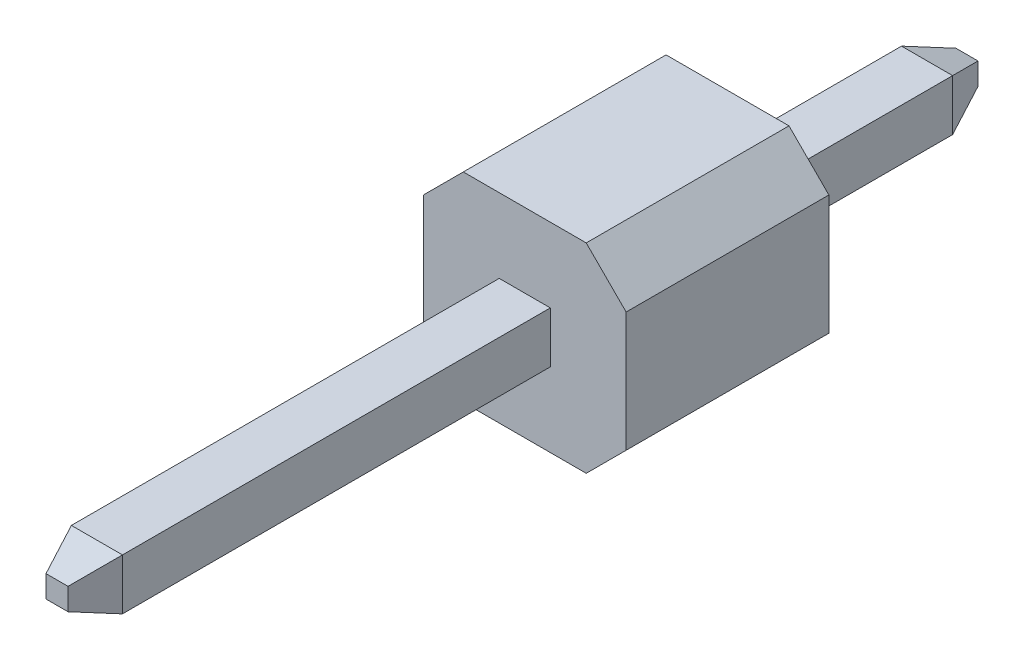
ISO-10303-21;
HEADER;
FILE_DESCRIPTION(('STEP AP214'),'2;1');
FILE_NAME('part.step','',(''),(''),'','','');
FILE_SCHEMA(('AUTOMOTIVE_DESIGN { 1 0 10303 214 1 1 1 1 }'));
ENDSEC;
DATA;
#1=APPLICATION_CONTEXT('core data for automotive mechanical design processes');
#2=APPLICATION_PROTOCOL_DEFINITION('international standard','automotive_design',2000,#1);
#3=PRODUCT_CONTEXT('',#1,'mechanical');
#4=PRODUCT('Part','Part','',(#3));
#5=PRODUCT_RELATED_PRODUCT_CATEGORY('part','',(#4));
#6=PRODUCT_DEFINITION_FORMATION('','',#4);
#7=PRODUCT_DEFINITION_CONTEXT('part definition',#1,'design');
#8=PRODUCT_DEFINITION('design','',#6,#7);
#9=PRODUCT_DEFINITION_SHAPE('','',#8);
#10=(LENGTH_UNIT() NAMED_UNIT(*) SI_UNIT(.MILLI.,.METRE.));
#11=(NAMED_UNIT(*) PLANE_ANGLE_UNIT() SI_UNIT($,.RADIAN.));
#12=(NAMED_UNIT(*) SI_UNIT($,.STERADIAN.) SOLID_ANGLE_UNIT());
#13=UNCERTAINTY_MEASURE_WITH_UNIT(LENGTH_MEASURE(1.E-05),#10,'distance_accuracy_value','');
#14=(GEOMETRIC_REPRESENTATION_CONTEXT(3) GLOBAL_UNCERTAINTY_ASSIGNED_CONTEXT((#13)) GLOBAL_UNIT_ASSIGNED_CONTEXT((#10,
#11,#12)) REPRESENTATION_CONTEXT('',''));
#15=CARTESIAN_POINT('',(0.,0.,0.));
#16=DIRECTION('',(0.,0.,1.));
#17=DIRECTION('',(1.,0.,0.));
#18=AXIS2_PLACEMENT_3D('',#15,#16,#17);
#19=CARTESIAN_POINT('',(-0.32,0.32,8.4));
#20=DIRECTION('',(1.,0.,0.));
#21=DIRECTION('',(0.,1.,0.));
#22=AXIS2_PLACEMENT_3D('',#19,#20,#21);
#23=PLANE('',#22);
#24=DIRECTION('',(0.,0.,-1.));
#25=VECTOR('',#24,1.);
#26=CARTESIAN_POINT('',(-0.32,0.32,8.4));
#27=LINE('',#26,#25);
#28=CARTESIAN_POINT('',(-0.32,0.32,7.9));
#29=VERTEX_POINT('',#28);
#30=CARTESIAN_POINT('',(-0.32,0.32,2.54));
#31=VERTEX_POINT('',#30);
#32=EDGE_CURVE('E181',#29,#31,#27,.T.);
#33=ORIENTED_EDGE('',*,*,#32,.T.);
#34=DIRECTION('',(0.,-1.,0.));
#35=VECTOR('',#34,1.);
#36=CARTESIAN_POINT('',(-0.32,0.32,2.54));
#37=LINE('',#36,#35);
#38=CARTESIAN_POINT('',(-0.32,-0.32,2.54));
#39=VERTEX_POINT('',#38);
#40=EDGE_CURVE('E279',#31,#39,#37,.T.);
#41=ORIENTED_EDGE('',*,*,#40,.T.);
#42=DIRECTION('',(0.,0.,-1.));
#43=VECTOR('',#42,1.);
#44=CARTESIAN_POINT('',(-0.32,-0.32,8.4));
#45=LINE('',#44,#43);
#46=CARTESIAN_POINT('',(-0.32,-0.32,7.9));
#47=VERTEX_POINT('',#46);
#48=EDGE_CURVE('E292',#47,#39,#45,.T.);
#49=ORIENTED_EDGE('',*,*,#48,.F.);
#50=DIRECTION('',(0.,1.,0.));
#51=VECTOR('',#50,1.);
#52=CARTESIAN_POINT('',(-0.32,0.32,7.9));
#53=LINE('',#52,#51);
#54=EDGE_CURVE('E307',#47,#29,#53,.T.);
#55=ORIENTED_EDGE('',*,*,#54,.T.);
#56=EDGE_LOOP('',(#33,#41,#49,#55));
#57=FACE_BOUND('',#56,.T.);
#58=ADVANCED_FACE('F32',(#57),#23,.F.);
#59=CARTESIAN_POINT('',(-0.32,-0.32,8.4));
#60=DIRECTION('',(0.,1.,0.));
#61=DIRECTION('',(0.,0.,1.));
#62=AXIS2_PLACEMENT_3D('',#59,#60,#61);
#63=PLANE('',#62);
#64=ORIENTED_EDGE('',*,*,#48,.T.);
#65=DIRECTION('',(1.,0.,0.));
#66=VECTOR('',#65,1.);
#67=CARTESIAN_POINT('',(-0.32,-0.32,2.54));
#68=LINE('',#67,#66);
#69=CARTESIAN_POINT('',(0.32,-0.32,2.54));
#70=VERTEX_POINT('',#69);
#71=EDGE_CURVE('E276',#39,#70,#68,.T.);
#72=ORIENTED_EDGE('',*,*,#71,.T.);
#73=DIRECTION('',(0.,0.,-1.));
#74=VECTOR('',#73,1.);
#75=CARTESIAN_POINT('',(0.32,-0.32,8.4));
#76=LINE('',#75,#74);
#77=CARTESIAN_POINT('',(0.32,-0.32,7.9));
#78=VERTEX_POINT('',#77);
#79=EDGE_CURVE('E289',#78,#70,#76,.T.);
#80=ORIENTED_EDGE('',*,*,#79,.F.);
#81=DIRECTION('',(-1.,0.,0.));
#82=VECTOR('',#81,1.);
#83=CARTESIAN_POINT('',(-0.32,-0.32,7.9));
#84=LINE('',#83,#82);
#85=EDGE_CURVE('E317',#78,#47,#84,.T.);
#86=ORIENTED_EDGE('',*,*,#85,.T.);
#87=EDGE_LOOP('',(#64,#72,#80,#86));
#88=FACE_BOUND('',#87,.T.);
#89=ADVANCED_FACE('F366',(#88),#63,.F.);
#90=CARTESIAN_POINT('',(0.32,0.32,8.4));
#91=DIRECTION('',(-1.,0.,0.));
#92=DIRECTION('',(0.,0.,1.));
#93=AXIS2_PLACEMENT_3D('',#90,#91,#92);
#94=PLANE('',#93);
#95=ORIENTED_EDGE('',*,*,#79,.T.);
#96=DIRECTION('',(0.,1.,0.));
#97=VECTOR('',#96,1.);
#98=CARTESIAN_POINT('',(0.32,0.32,2.54));
#99=LINE('',#98,#97);
#100=CARTESIAN_POINT('',(0.32,0.32,2.54));
#101=VERTEX_POINT('',#100);
#102=EDGE_CURVE('E191',#70,#101,#99,.T.);
#103=ORIENTED_EDGE('',*,*,#102,.T.);
#104=DIRECTION('',(0.,0.,-1.));
#105=VECTOR('',#104,1.);
#106=CARTESIAN_POINT('',(0.32,0.32,8.4));
#107=LINE('',#106,#105);
#108=CARTESIAN_POINT('',(0.32,0.32,7.9));
#109=VERTEX_POINT('',#108);
#110=EDGE_CURVE('E285',#109,#101,#107,.T.);
#111=ORIENTED_EDGE('',*,*,#110,.F.);
#112=DIRECTION('',(0.,-1.,0.));
#113=VECTOR('',#112,1.);
#114=CARTESIAN_POINT('',(0.32,-0.32,7.9));
#115=LINE('',#114,#113);
#116=EDGE_CURVE('E311',#109,#78,#115,.T.);
#117=ORIENTED_EDGE('',*,*,#116,.T.);
#118=EDGE_LOOP('',(#95,#103,#111,#117));
#119=FACE_BOUND('',#118,.T.);
#120=ADVANCED_FACE('F362',(#119),#94,.F.);
#121=CARTESIAN_POINT('',(-0.32,0.32,8.4));
#122=DIRECTION('',(0.,-1.,0.));
#123=DIRECTION('',(0.,0.,-1.));
#124=AXIS2_PLACEMENT_3D('',#121,#122,#123);
#125=PLANE('',#124);
#126=ORIENTED_EDGE('',*,*,#110,.T.);
#127=DIRECTION('',(-1.,0.,0.));
#128=VECTOR('',#127,1.);
#129=CARTESIAN_POINT('',(-0.32,0.32,2.54));
#130=LINE('',#129,#128);
#131=EDGE_CURVE('E197',#101,#31,#130,.T.);
#132=ORIENTED_EDGE('',*,*,#131,.T.);
#133=ORIENTED_EDGE('',*,*,#32,.F.);
#134=DIRECTION('',(1.,0.,0.));
#135=VECTOR('',#134,1.);
#136=CARTESIAN_POINT('',(0.32,0.32,7.9));
#137=LINE('',#136,#135);
#138=EDGE_CURVE('E304',#29,#109,#137,.T.);
#139=ORIENTED_EDGE('',*,*,#138,.T.);
#140=EDGE_LOOP('',(#126,#132,#133,#139));
#141=FACE_BOUND('',#140,.T.);
#142=ADVANCED_FACE('F359',(#141),#125,.F.);
#143=CARTESIAN_POINT('',(0.,0.,8.4));
#144=DIRECTION('',(0.,0.,1.));
#145=DIRECTION('',(1.,0.,0.));
#146=AXIS2_PLACEMENT_3D('',#143,#144,#145);
#147=PLANE('',#146);
#148=DIRECTION('',(1.,0.,0.));
#149=VECTOR('',#148,1.);
#150=CARTESIAN_POINT('',(0.32,-0.138014882866899,8.4));
#151=LINE('',#150,#149);
#152=CARTESIAN_POINT('',(-0.138014882866899,-0.138014882866899,8.4));
#153=VERTEX_POINT('',#152);
#154=CARTESIAN_POINT('',(0.138014882866899,-0.138014882866899,8.4));
#155=VERTEX_POINT('',#154);
#156=EDGE_CURVE('E322',#153,#155,#151,.T.);
#157=ORIENTED_EDGE('',*,*,#156,.T.);
#158=DIRECTION('',(0.,1.,0.));
#159=VECTOR('',#158,1.);
#160=CARTESIAN_POINT('',(0.138014882866899,0.32,8.4));
#161=LINE('',#160,#159);
#162=CARTESIAN_POINT('',(0.138014882866899,0.138014882866899,8.4));
#163=VERTEX_POINT('',#162);
#164=EDGE_CURVE('E198',#155,#163,#161,.T.);
#165=ORIENTED_EDGE('',*,*,#164,.T.);
#166=DIRECTION('',(-1.,0.,0.));
#167=VECTOR('',#166,1.);
#168=CARTESIAN_POINT('',(-0.32,0.138014882866899,8.4));
#169=LINE('',#168,#167);
#170=CARTESIAN_POINT('',(-0.138014882866899,0.138014882866899,8.4));
#171=VERTEX_POINT('',#170);
#172=EDGE_CURVE('E204',#163,#171,#169,.T.);
#173=ORIENTED_EDGE('',*,*,#172,.T.);
#174=DIRECTION('',(0.,-1.,0.));
#175=VECTOR('',#174,1.);
#176=CARTESIAN_POINT('',(-0.138014882866899,-0.32,8.4));
#177=LINE('',#176,#175);
#178=EDGE_CURVE('E324',#171,#153,#177,.T.);
#179=ORIENTED_EDGE('',*,*,#178,.T.);
#180=EDGE_LOOP('',(#157,#165,#173,#179));
#181=FACE_BOUND('',#180,.T.);
#182=ADVANCED_FACE('F427',(#181),#147,.T.);
#183=CARTESIAN_POINT('',(-0.138014882866899,0.,8.4));
#184=DIRECTION('',(-0.939692620785909,0.,0.342020143325666));
#185=DIRECTION('',(0.,1.,0.));
#186=AXIS2_PLACEMENT_3D('',#183,#184,#185);
#187=PLANE('',#186);
#188=DIRECTION('',(-0.323615577118182,0.323615577118182,-0.88912649071599));
#189=VECTOR('',#188,1.);
#190=CARTESIAN_POINT('',(-0.123560992466288,0.123560992466288,8.43971173749895));
#191=LINE('',#190,#189);
#192=EDGE_CURVE('E338',#29,#171,#191,.F.);
#193=ORIENTED_EDGE('',*,*,#192,.F.);
#194=ORIENTED_EDGE('',*,*,#54,.F.);
#195=DIRECTION('',(-0.323615577118182,-0.323615577118182,-0.88912649071599));
#196=VECTOR('',#195,1.);
#197=CARTESIAN_POINT('',(-0.123560992466288,-0.123560992466288,8.43971173749895));
#198=LINE('',#197,#196);
#199=EDGE_CURVE('E207',#153,#47,#198,.T.);
#200=ORIENTED_EDGE('',*,*,#199,.F.);
#201=ORIENTED_EDGE('',*,*,#178,.F.);
#202=EDGE_LOOP('',(#193,#194,#200,#201));
#203=FACE_BOUND('',#202,.T.);
#204=ADVANCED_FACE('F354',(#203),#187,.T.);
#205=CARTESIAN_POINT('',(0.,-0.138014882866899,8.4));
#206=DIRECTION('',(0.,-0.939692620785909,0.342020143325666));
#207=DIRECTION('',(-1.,0.,0.));
#208=AXIS2_PLACEMENT_3D('',#205,#206,#207);
#209=PLANE('',#208);
#210=ORIENTED_EDGE('',*,*,#199,.T.);
#211=ORIENTED_EDGE('',*,*,#85,.F.);
#212=DIRECTION('',(-0.323615577118182,0.323615577118182,0.88912649071599));
#213=VECTOR('',#212,1.);
#214=CARTESIAN_POINT('',(0.123560992466288,-0.123560992466288,8.43971173749895));
#215=LINE('',#214,#213);
#216=EDGE_CURVE('E337',#155,#78,#215,.F.);
#217=ORIENTED_EDGE('',*,*,#216,.F.);
#218=ORIENTED_EDGE('',*,*,#156,.F.);
#219=EDGE_LOOP('',(#210,#211,#217,#218));
#220=FACE_BOUND('',#219,.T.);
#221=ADVANCED_FACE('F349',(#220),#209,.T.);
#222=CARTESIAN_POINT('',(0.,0.138014882866899,8.4));
#223=DIRECTION('',(0.,0.939692620785909,0.342020143325666));
#224=DIRECTION('',(1.,0.,0.));
#225=AXIS2_PLACEMENT_3D('',#222,#223,#224);
#226=PLANE('',#225);
#227=ORIENTED_EDGE('',*,*,#192,.T.);
#228=ORIENTED_EDGE('',*,*,#172,.F.);
#229=DIRECTION('',(0.323615577118182,0.323615577118182,-0.88912649071599));
#230=VECTOR('',#229,1.);
#231=CARTESIAN_POINT('',(0.123560992466288,0.123560992466288,8.43971173749895));
#232=LINE('',#231,#230);
#233=EDGE_CURVE('E281',#109,#163,#232,.F.);
#234=ORIENTED_EDGE('',*,*,#233,.F.);
#235=ORIENTED_EDGE('',*,*,#138,.F.);
#236=EDGE_LOOP('',(#227,#228,#234,#235));
#237=FACE_BOUND('',#236,.T.);
#238=ADVANCED_FACE('F419',(#237),#226,.T.);
#239=CARTESIAN_POINT('',(0.138014882866899,0.,8.4));
#240=DIRECTION('',(0.939692620785909,0.,0.342020143325666));
#241=DIRECTION('',(0.,-1.,0.));
#242=AXIS2_PLACEMENT_3D('',#239,#240,#241);
#243=PLANE('',#242);
#244=ORIENTED_EDGE('',*,*,#216,.T.);
#245=ORIENTED_EDGE('',*,*,#116,.F.);
#246=ORIENTED_EDGE('',*,*,#233,.T.);
#247=ORIENTED_EDGE('',*,*,#164,.F.);
#248=EDGE_LOOP('',(#244,#245,#246,#247));
#249=FACE_BOUND('',#248,.T.);
#250=ADVANCED_FACE('F416',(#249),#243,.T.);
#251=CARTESIAN_POINT('',(0.,0.,2.54));
#252=DIRECTION('',(0.,0.,1.));
#253=DIRECTION('',(1.,0.,0.));
#254=AXIS2_PLACEMENT_3D('',#251,#252,#253);
#255=PLANE('',#254);
#256=DIRECTION('',(0.,1.,0.));
#257=VECTOR('',#256,1.);
#258=CARTESIAN_POINT('',(1.27,1.25,2.54));
#259=LINE('',#258,#257);
#260=CARTESIAN_POINT('',(1.27,-0.749999999999998,2.54));
#261=VERTEX_POINT('',#260);
#262=CARTESIAN_POINT('',(1.27,0.75,2.54));
#263=VERTEX_POINT('',#262);
#264=EDGE_CURVE('E451',#261,#263,#259,.T.);
#265=ORIENTED_EDGE('',*,*,#264,.T.);
#266=DIRECTION('',(0.707106781186548,-0.707106781186548,0.));
#267=VECTOR('',#266,1.);
#268=CARTESIAN_POINT('',(1.01,1.01,2.54));
#269=LINE('',#268,#267);
#270=CARTESIAN_POINT('',(0.77,1.25,2.54));
#271=VERTEX_POINT('',#270);
#272=EDGE_CURVE('E232',#263,#271,#269,.F.);
#273=ORIENTED_EDGE('',*,*,#272,.T.);
#274=DIRECTION('',(-1.,0.,0.));
#275=VECTOR('',#274,1.);
#276=CARTESIAN_POINT('',(-1.27,1.25,2.54));
#277=LINE('',#276,#275);
#278=CARTESIAN_POINT('',(-0.769999999999998,1.25,2.54));
#279=VERTEX_POINT('',#278);
#280=EDGE_CURVE('E272',#271,#279,#277,.T.);
#281=ORIENTED_EDGE('',*,*,#280,.T.);
#282=DIRECTION('',(0.70710678118655,0.707106781186545,0.));
#283=VECTOR('',#282,1.);
#284=CARTESIAN_POINT('',(-1.01,1.01,2.54));
#285=LINE('',#284,#283);
#286=CARTESIAN_POINT('',(-1.27,0.750000000000001,2.54));
#287=VERTEX_POINT('',#286);
#288=EDGE_CURVE('E228',#279,#287,#285,.F.);
#289=ORIENTED_EDGE('',*,*,#288,.T.);
#290=DIRECTION('',(0.,-1.,0.));
#291=VECTOR('',#290,1.);
#292=CARTESIAN_POINT('',(-1.27,1.25,2.54));
#293=LINE('',#292,#291);
#294=CARTESIAN_POINT('',(-1.27,-0.749999999999996,2.54));
#295=VERTEX_POINT('',#294);
#296=EDGE_CURVE('E242',#287,#295,#293,.T.);
#297=ORIENTED_EDGE('',*,*,#296,.T.);
#298=DIRECTION('',(-0.707106781186546,0.707106781186549,0.));
#299=VECTOR('',#298,1.);
#300=CARTESIAN_POINT('',(-1.01,-1.01,2.54));
#301=LINE('',#300,#299);
#302=CARTESIAN_POINT('',(-0.769999999999998,-1.25,2.54));
#303=VERTEX_POINT('',#302);
#304=EDGE_CURVE('E54',#295,#303,#301,.F.);
#305=ORIENTED_EDGE('',*,*,#304,.T.);
#306=DIRECTION('',(1.,0.,0.));
#307=VECTOR('',#306,1.);
#308=CARTESIAN_POINT('',(-1.27,-1.25,2.54));
#309=LINE('',#308,#307);
#310=CARTESIAN_POINT('',(0.769999999999996,-1.25,2.54));
#311=VERTEX_POINT('',#310);
#312=EDGE_CURVE('E252',#303,#311,#309,.T.);
#313=ORIENTED_EDGE('',*,*,#312,.T.);
#314=DIRECTION('',(-0.707106781186549,-0.707106781186546,0.));
#315=VECTOR('',#314,1.);
#316=CARTESIAN_POINT('',(1.01,-1.01,2.54));
#317=LINE('',#316,#315);
#318=EDGE_CURVE('E230',#311,#261,#317,.F.);
#319=ORIENTED_EDGE('',*,*,#318,.T.);
#320=EDGE_LOOP('',(#265,#273,#281,#289,#297,#305,#313,#319));
#321=FACE_BOUND('',#320,.T.);
#322=ORIENTED_EDGE('',*,*,#40,.F.);
#323=ORIENTED_EDGE('',*,*,#131,.F.);
#324=ORIENTED_EDGE('',*,*,#102,.F.);
#325=ORIENTED_EDGE('',*,*,#71,.F.);
#326=EDGE_LOOP('',(#322,#323,#324,#325));
#327=FACE_BOUND('',#326,.T.);
#328=ADVANCED_FACE('F248',(#321,#327),#255,.T.);
#329=CARTESIAN_POINT('',(0.,0.,0.));
#330=DIRECTION('',(0.,0.,1.));
#331=DIRECTION('',(1.,0.,0.));
#332=AXIS2_PLACEMENT_3D('',#329,#330,#331);
#333=PLANE('',#332);
#334=DIRECTION('',(-1.,0.,0.));
#335=VECTOR('',#334,1.);
#336=CARTESIAN_POINT('',(-1.27,1.25,0.));
#337=LINE('',#336,#335);
#338=CARTESIAN_POINT('',(0.77,1.25,0.));
#339=VERTEX_POINT('',#338);
#340=CARTESIAN_POINT('',(-0.769999999999998,1.25,0.));
#341=VERTEX_POINT('',#340);
#342=EDGE_CURVE('E253',#339,#341,#337,.T.);
#343=ORIENTED_EDGE('',*,*,#342,.F.);
#344=DIRECTION('',(-0.707106781186548,0.707106781186548,0.));
#345=VECTOR('',#344,1.);
#346=CARTESIAN_POINT('',(0.77,1.25,0.));
#347=LINE('',#346,#345);
#348=CARTESIAN_POINT('',(1.27,0.75,0.));
#349=VERTEX_POINT('',#348);
#350=EDGE_CURVE('E220',#339,#349,#347,.F.);
#351=ORIENTED_EDGE('',*,*,#350,.T.);
#352=DIRECTION('',(0.,1.,0.));
#353=VECTOR('',#352,1.);
#354=CARTESIAN_POINT('',(1.27,1.25,0.));
#355=LINE('',#354,#353);
#356=CARTESIAN_POINT('',(1.27,-0.749999999999998,0.));
#357=VERTEX_POINT('',#356);
#358=EDGE_CURVE('E262',#357,#349,#355,.T.);
#359=ORIENTED_EDGE('',*,*,#358,.F.);
#360=DIRECTION('',(0.707106781186549,0.707106781186546,0.));
#361=VECTOR('',#360,1.);
#362=CARTESIAN_POINT('',(1.27,-0.749999999999998,0.));
#363=LINE('',#362,#361);
#364=CARTESIAN_POINT('',(0.769999999999996,-1.25,0.));
#365=VERTEX_POINT('',#364);
#366=EDGE_CURVE('E218',#357,#365,#363,.F.);
#367=ORIENTED_EDGE('',*,*,#366,.T.);
#368=DIRECTION('',(1.,0.,0.));
#369=VECTOR('',#368,1.);
#370=CARTESIAN_POINT('',(-1.27,-1.25,0.));
#371=LINE('',#370,#369);
#372=CARTESIAN_POINT('',(-0.769999999999998,-1.25,0.));
#373=VERTEX_POINT('',#372);
#374=EDGE_CURVE('E258',#373,#365,#371,.T.);
#375=ORIENTED_EDGE('',*,*,#374,.F.);
#376=DIRECTION('',(0.707106781186546,-0.707106781186549,0.));
#377=VECTOR('',#376,1.);
#378=CARTESIAN_POINT('',(-0.769999999999998,-1.25,0.));
#379=LINE('',#378,#377);
#380=CARTESIAN_POINT('',(-1.27,-0.749999999999996,0.));
#381=VERTEX_POINT('',#380);
#382=EDGE_CURVE('E214',#373,#381,#379,.F.);
#383=ORIENTED_EDGE('',*,*,#382,.T.);
#384=DIRECTION('',(0.,-1.,0.));
#385=VECTOR('',#384,1.);
#386=CARTESIAN_POINT('',(-1.27,1.25,0.));
#387=LINE('',#386,#385);
#388=CARTESIAN_POINT('',(-1.27,0.750000000000001,0.));
#389=VERTEX_POINT('',#388);
#390=EDGE_CURVE('E245',#389,#381,#387,.T.);
#391=ORIENTED_EDGE('',*,*,#390,.F.);
#392=DIRECTION('',(-0.70710678118655,-0.707106781186545,0.));
#393=VECTOR('',#392,1.);
#394=CARTESIAN_POINT('',(-1.27,0.750000000000001,0.));
#395=LINE('',#394,#393);
#396=EDGE_CURVE('E216',#389,#341,#395,.F.);
#397=ORIENTED_EDGE('',*,*,#396,.T.);
#398=EDGE_LOOP('',(#343,#351,#359,#367,#375,#383,#391,#397));
#399=FACE_BOUND('',#398,.T.);
#400=DIRECTION('',(-1.,0.,0.));
#401=VECTOR('',#400,1.);
#402=CARTESIAN_POINT('',(-0.32,0.32,0.));
#403=LINE('',#402,#401);
#404=CARTESIAN_POINT('',(0.32,0.32,0.));
#405=VERTEX_POINT('',#404);
#406=CARTESIAN_POINT('',(-0.32,0.32,0.));
#407=VERTEX_POINT('',#406);
#408=EDGE_CURVE('E174',#405,#407,#403,.T.);
#409=ORIENTED_EDGE('',*,*,#408,.T.);
#410=DIRECTION('',(0.,-1.,0.));
#411=VECTOR('',#410,1.);
#412=CARTESIAN_POINT('',(-0.32,0.32,0.));
#413=LINE('',#412,#411);
#414=CARTESIAN_POINT('',(-0.32,-0.32,0.));
#415=VERTEX_POINT('',#414);
#416=EDGE_CURVE('E186',#407,#415,#413,.T.);
#417=ORIENTED_EDGE('',*,*,#416,.T.);
#418=DIRECTION('',(1.,0.,0.));
#419=VECTOR('',#418,1.);
#420=CARTESIAN_POINT('',(-0.32,-0.32,0.));
#421=LINE('',#420,#419);
#422=CARTESIAN_POINT('',(0.32,-0.32,0.));
#423=VERTEX_POINT('',#422);
#424=EDGE_CURVE('E192',#415,#423,#421,.T.);
#425=ORIENTED_EDGE('',*,*,#424,.T.);
#426=DIRECTION('',(0.,1.,0.));
#427=VECTOR('',#426,1.);
#428=CARTESIAN_POINT('',(0.32,0.32,0.));
#429=LINE('',#428,#427);
#430=EDGE_CURVE('E196',#423,#405,#429,.T.);
#431=ORIENTED_EDGE('',*,*,#430,.T.);
#432=EDGE_LOOP('',(#409,#417,#425,#431));
#433=FACE_BOUND('',#432,.T.);
#434=ADVANCED_FACE('F195',(#399,#433),#333,.F.);
#435=CARTESIAN_POINT('',(-1.27,1.25,2.54));
#436=DIRECTION('',(1.,0.,0.));
#437=DIRECTION('',(0.,0.,-1.));
#438=AXIS2_PLACEMENT_3D('',#435,#436,#437);
#439=PLANE('',#438);
#440=ORIENTED_EDGE('',*,*,#296,.F.);
#441=DIRECTION('',(0.,0.,-1.));
#442=VECTOR('',#441,1.);
#443=CARTESIAN_POINT('',(-1.27,0.750000000000001,2.54));
#444=LINE('',#443,#442);
#445=EDGE_CURVE('E11',#287,#389,#444,.T.);
#446=ORIENTED_EDGE('',*,*,#445,.T.);
#447=ORIENTED_EDGE('',*,*,#390,.T.);
#448=DIRECTION('',(0.,0.,1.));
#449=VECTOR('',#448,1.);
#450=CARTESIAN_POINT('',(-1.27,-0.749999999999996,2.54));
#451=LINE('',#450,#449);
#452=EDGE_CURVE('E40',#381,#295,#451,.T.);
#453=ORIENTED_EDGE('',*,*,#452,.T.);
#454=EDGE_LOOP('',(#440,#446,#447,#453));
#455=FACE_BOUND('',#454,.T.);
#456=ADVANCED_FACE('F241',(#455),#439,.F.);
#457=CARTESIAN_POINT('',(-1.27,-1.25,2.54));
#458=DIRECTION('',(0.,1.,0.));
#459=DIRECTION('',(-1.,0.,0.));
#460=AXIS2_PLACEMENT_3D('',#457,#458,#459);
#461=PLANE('',#460);
#462=ORIENTED_EDGE('',*,*,#374,.T.);
#463=DIRECTION('',(0.,0.,1.));
#464=VECTOR('',#463,1.);
#465=CARTESIAN_POINT('',(0.769999999999996,-1.25,2.54));
#466=LINE('',#465,#464);
#467=EDGE_CURVE('E47',#365,#311,#466,.T.);
#468=ORIENTED_EDGE('',*,*,#467,.T.);
#469=ORIENTED_EDGE('',*,*,#312,.F.);
#470=DIRECTION('',(0.,0.,-1.));
#471=VECTOR('',#470,1.);
#472=CARTESIAN_POINT('',(-0.769999999999998,-1.25,2.54));
#473=LINE('',#472,#471);
#474=EDGE_CURVE('E234',#303,#373,#473,.T.);
#475=ORIENTED_EDGE('',*,*,#474,.T.);
#476=EDGE_LOOP('',(#462,#468,#469,#475));
#477=FACE_BOUND('',#476,.T.);
#478=ADVANCED_FACE('F257',(#477),#461,.F.);
#479=CARTESIAN_POINT('',(1.27,1.25,2.54));
#480=DIRECTION('',(-1.,0.,0.));
#481=DIRECTION('',(0.,0.,1.));
#482=AXIS2_PLACEMENT_3D('',#479,#480,#481);
#483=PLANE('',#482);
#484=ORIENTED_EDGE('',*,*,#358,.T.);
#485=DIRECTION('',(0.,0.,1.));
#486=VECTOR('',#485,1.);
#487=CARTESIAN_POINT('',(1.27,0.75,2.54));
#488=LINE('',#487,#486);
#489=EDGE_CURVE('E225',#349,#263,#488,.T.);
#490=ORIENTED_EDGE('',*,*,#489,.T.);
#491=ORIENTED_EDGE('',*,*,#264,.F.);
#492=DIRECTION('',(0.,0.,-1.));
#493=VECTOR('',#492,1.);
#494=CARTESIAN_POINT('',(1.27,-0.749999999999998,2.54));
#495=LINE('',#494,#493);
#496=EDGE_CURVE('E222',#261,#357,#495,.T.);
#497=ORIENTED_EDGE('',*,*,#496,.T.);
#498=EDGE_LOOP('',(#484,#490,#491,#497));
#499=FACE_BOUND('',#498,.T.);
#500=ADVANCED_FACE('F448',(#499),#483,.F.);
#501=CARTESIAN_POINT('',(-1.27,1.25,2.54));
#502=DIRECTION('',(0.,-1.,0.));
#503=DIRECTION('',(1.,0.,0.));
#504=AXIS2_PLACEMENT_3D('',#501,#502,#503);
#505=PLANE('',#504);
#506=ORIENTED_EDGE('',*,*,#280,.F.);
#507=DIRECTION('',(0.,0.,-1.));
#508=VECTOR('',#507,1.);
#509=CARTESIAN_POINT('',(0.77,1.25,2.54));
#510=LINE('',#509,#508);
#511=EDGE_CURVE('E211',#271,#339,#510,.T.);
#512=ORIENTED_EDGE('',*,*,#511,.T.);
#513=ORIENTED_EDGE('',*,*,#342,.T.);
#514=DIRECTION('',(0.,0.,1.));
#515=VECTOR('',#514,1.);
#516=CARTESIAN_POINT('',(-0.769999999999998,1.25,2.54));
#517=LINE('',#516,#515);
#518=EDGE_CURVE('E201',#341,#279,#517,.T.);
#519=ORIENTED_EDGE('',*,*,#518,.T.);
#520=EDGE_LOOP('',(#506,#512,#513,#519));
#521=FACE_BOUND('',#520,.T.);
#522=ADVANCED_FACE('F443',(#521),#505,.F.);
#523=CARTESIAN_POINT('',(0.,0.,-3.));
#524=DIRECTION('',(0.,0.,1.));
#525=DIRECTION('',(1.,0.,0.));
#526=AXIS2_PLACEMENT_3D('',#523,#524,#525);
#527=PLANE('',#526);
#528=DIRECTION('',(0.,1.,0.));
#529=VECTOR('',#528,1.);
#530=CARTESIAN_POINT('',(-0.138014882866899,0.,-3.));
#531=LINE('',#530,#529);
#532=CARTESIAN_POINT('',(-0.138014882866899,-0.138014882866899,-3.));
#533=VERTEX_POINT('',#532);
#534=CARTESIAN_POINT('',(-0.138014882866899,0.138014882866899,-3.));
#535=VERTEX_POINT('',#534);
#536=EDGE_CURVE('E299',#533,#535,#531,.T.);
#537=ORIENTED_EDGE('',*,*,#536,.T.);
#538=DIRECTION('',(1.,0.,0.));
#539=VECTOR('',#538,1.);
#540=CARTESIAN_POINT('',(0.,0.138014882866899,-3.));
#541=LINE('',#540,#539);
#542=CARTESIAN_POINT('',(0.138014882866899,0.138014882866899,-3.));
#543=VERTEX_POINT('',#542);
#544=EDGE_CURVE('E301',#535,#543,#541,.T.);
#545=ORIENTED_EDGE('',*,*,#544,.T.);
#546=DIRECTION('',(0.,-1.,0.));
#547=VECTOR('',#546,1.);
#548=CARTESIAN_POINT('',(0.138014882866899,0.,-3.));
#549=LINE('',#548,#547);
#550=CARTESIAN_POINT('',(0.138014882866899,-0.138014882866899,-3.));
#551=VERTEX_POINT('',#550);
#552=EDGE_CURVE('E297',#543,#551,#549,.T.);
#553=ORIENTED_EDGE('',*,*,#552,.T.);
#554=DIRECTION('',(-1.,0.,0.));
#555=VECTOR('',#554,1.);
#556=CARTESIAN_POINT('',(0.,-0.138014882866899,-3.));
#557=LINE('',#556,#555);
#558=EDGE_CURVE('E295',#551,#533,#557,.T.);
#559=ORIENTED_EDGE('',*,*,#558,.T.);
#560=EDGE_LOOP('',(#537,#545,#553,#559));
#561=FACE_BOUND('',#560,.T.);
#562=ADVANCED_FACE('F400',(#561),#527,.F.);
#563=CARTESIAN_POINT('',(-0.138014882866899,0.,-3.));
#564=DIRECTION('',(0.939692620785909,0.,0.342020143325667));
#565=DIRECTION('',(0.,1.,0.));
#566=AXIS2_PLACEMENT_3D('',#563,#564,#565);
#567=PLANE('',#566);
#568=DIRECTION('',(0.323615577118184,0.323615577118184,-0.889126490715989));
#569=VECTOR('',#568,1.);
#570=CARTESIAN_POINT('',(-0.123560992466288,-0.123560992466288,-3.03971173749895));
#571=LINE('',#570,#569);
#572=CARTESIAN_POINT('',(-0.32,-0.32,-2.5));
#573=VERTEX_POINT('',#572);
#574=EDGE_CURVE('E182',#533,#573,#571,.F.);
#575=ORIENTED_EDGE('',*,*,#574,.T.);
#576=DIRECTION('',(0.,-1.,0.));
#577=VECTOR('',#576,1.);
#578=CARTESIAN_POINT('',(-0.32,0.32,-2.5));
#579=LINE('',#578,#577);
#580=CARTESIAN_POINT('',(-0.32,0.32,-2.5));
#581=VERTEX_POINT('',#580);
#582=EDGE_CURVE('E309',#581,#573,#579,.T.);
#583=ORIENTED_EDGE('',*,*,#582,.F.);
#584=DIRECTION('',(0.323615577118184,-0.323615577118184,-0.889126490715989));
#585=VECTOR('',#584,1.);
#586=CARTESIAN_POINT('',(-0.123560992466288,0.123560992466288,-3.03971173749895));
#587=LINE('',#586,#585);
#588=EDGE_CURVE('E329',#535,#581,#587,.F.);
#589=ORIENTED_EDGE('',*,*,#588,.F.);
#590=ORIENTED_EDGE('',*,*,#536,.F.);
#591=EDGE_LOOP('',(#575,#583,#589,#590));
#592=FACE_BOUND('',#591,.T.);
#593=ADVANCED_FACE('F404',(#592),#567,.F.);
#594=CARTESIAN_POINT('',(0.,-0.138014882866899,-3.));
#595=DIRECTION('',(0.,0.939692620785909,0.342020143325667));
#596=DIRECTION('',(-1.,0.,0.));
#597=AXIS2_PLACEMENT_3D('',#594,#595,#596);
#598=PLANE('',#597);
#599=DIRECTION('',(0.323615577118184,-0.323615577118184,0.889126490715989));
#600=VECTOR('',#599,1.);
#601=CARTESIAN_POINT('',(0.123560992466288,-0.123560992466288,-3.03971173749895));
#602=LINE('',#601,#600);
#603=CARTESIAN_POINT('',(0.32,-0.32,-2.5));
#604=VERTEX_POINT('',#603);
#605=EDGE_CURVE('E331',#604,#551,#602,.F.);
#606=ORIENTED_EDGE('',*,*,#605,.F.);
#607=DIRECTION('',(1.,0.,0.));
#608=VECTOR('',#607,1.);
#609=CARTESIAN_POINT('',(-0.32,-0.32,-2.5));
#610=LINE('',#609,#608);
#611=EDGE_CURVE('E319',#573,#604,#610,.T.);
#612=ORIENTED_EDGE('',*,*,#611,.F.);
#613=ORIENTED_EDGE('',*,*,#574,.F.);
#614=ORIENTED_EDGE('',*,*,#558,.F.);
#615=EDGE_LOOP('',(#606,#612,#613,#614));
#616=FACE_BOUND('',#615,.T.);
#617=ADVANCED_FACE('F406',(#616),#598,.F.);
#618=CARTESIAN_POINT('',(0.138014882866899,0.,-3.));
#619=DIRECTION('',(-0.939692620785909,0.,0.342020143325667));
#620=DIRECTION('',(0.,-1.,0.));
#621=AXIS2_PLACEMENT_3D('',#618,#619,#620);
#622=PLANE('',#621);
#623=ORIENTED_EDGE('',*,*,#605,.T.);
#624=ORIENTED_EDGE('',*,*,#552,.F.);
#625=DIRECTION('',(0.323615577118184,0.323615577118184,0.889126490715989));
#626=VECTOR('',#625,1.);
#627=CARTESIAN_POINT('',(0.123560992466288,0.123560992466288,-3.03971173749895));
#628=LINE('',#627,#626);
#629=CARTESIAN_POINT('',(0.32,0.32,-2.5));
#630=VERTEX_POINT('',#629);
#631=EDGE_CURVE('E327',#630,#543,#628,.F.);
#632=ORIENTED_EDGE('',*,*,#631,.F.);
#633=DIRECTION('',(0.,1.,0.));
#634=VECTOR('',#633,1.);
#635=CARTESIAN_POINT('',(0.32,0.32,-2.5));
#636=LINE('',#635,#634);
#637=EDGE_CURVE('E314',#604,#630,#636,.T.);
#638=ORIENTED_EDGE('',*,*,#637,.F.);
#639=EDGE_LOOP('',(#623,#624,#632,#638));
#640=FACE_BOUND('',#639,.T.);
#641=ADVANCED_FACE('F397',(#640),#622,.F.);
#642=CARTESIAN_POINT('',(0.,0.138014882866899,-3.));
#643=DIRECTION('',(0.,-0.939692620785909,0.342020143325667));
#644=DIRECTION('',(1.,0.,0.));
#645=AXIS2_PLACEMENT_3D('',#642,#643,#644);
#646=PLANE('',#645);
#647=ORIENTED_EDGE('',*,*,#588,.T.);
#648=DIRECTION('',(-1.,0.,0.));
#649=VECTOR('',#648,1.);
#650=CARTESIAN_POINT('',(-0.32,0.32,-2.5));
#651=LINE('',#650,#649);
#652=EDGE_CURVE('E177',#630,#581,#651,.T.);
#653=ORIENTED_EDGE('',*,*,#652,.F.);
#654=ORIENTED_EDGE('',*,*,#631,.T.);
#655=ORIENTED_EDGE('',*,*,#544,.F.);
#656=EDGE_LOOP('',(#647,#653,#654,#655));
#657=FACE_BOUND('',#656,.T.);
#658=ADVANCED_FACE('F392',(#657),#646,.F.);
#659=ORIENTED_EDGE('',*,*,#408,.F.);
#660=EDGE_CURVE('E284',#405,#630,#107,.T.);
#661=ORIENTED_EDGE('',*,*,#660,.T.);
#662=ORIENTED_EDGE('',*,*,#652,.T.);
#663=EDGE_CURVE('E170',#407,#581,#27,.T.);
#664=ORIENTED_EDGE('',*,*,#663,.F.);
#665=EDGE_LOOP('',(#659,#661,#662,#664));
#666=FACE_BOUND('',#665,.T.);
#667=ADVANCED_FACE('F172',(#666),#125,.F.);
#668=ORIENTED_EDGE('',*,*,#430,.F.);
#669=EDGE_CURVE('E288',#423,#604,#76,.T.);
#670=ORIENTED_EDGE('',*,*,#669,.T.);
#671=ORIENTED_EDGE('',*,*,#637,.T.);
#672=ORIENTED_EDGE('',*,*,#660,.F.);
#673=EDGE_LOOP('',(#668,#670,#671,#672));
#674=FACE_BOUND('',#673,.T.);
#675=ADVANCED_FACE('F375',(#674),#94,.F.);
#676=ORIENTED_EDGE('',*,*,#424,.F.);
#677=EDGE_CURVE('E188',#415,#573,#45,.T.);
#678=ORIENTED_EDGE('',*,*,#677,.T.);
#679=ORIENTED_EDGE('',*,*,#611,.T.);
#680=ORIENTED_EDGE('',*,*,#669,.F.);
#681=EDGE_LOOP('',(#676,#678,#679,#680));
#682=FACE_BOUND('',#681,.T.);
#683=ADVANCED_FACE('F369',(#682),#63,.F.);
#684=ORIENTED_EDGE('',*,*,#416,.F.);
#685=ORIENTED_EDGE('',*,*,#663,.T.);
#686=ORIENTED_EDGE('',*,*,#582,.T.);
#687=ORIENTED_EDGE('',*,*,#677,.F.);
#688=EDGE_LOOP('',(#684,#685,#686,#687));
#689=FACE_BOUND('',#688,.T.);
#690=ADVANCED_FACE('F187',(#689),#23,.F.);
#691=CARTESIAN_POINT('',(0.77,1.25,2.54));
#692=DIRECTION('',(-0.707106781186547,-0.707106781186547,0.));
#693=DIRECTION('',(0.,0.,-1.));
#694=AXIS2_PLACEMENT_3D('',#691,#692,#693);
#695=PLANE('',#694);
#696=ORIENTED_EDGE('',*,*,#272,.F.);
#697=ORIENTED_EDGE('',*,*,#489,.F.);
#698=ORIENTED_EDGE('',*,*,#350,.F.);
#699=ORIENTED_EDGE('',*,*,#511,.F.);
#700=EDGE_LOOP('',(#696,#697,#698,#699));
#701=FACE_BOUND('',#700,.T.);
#702=ADVANCED_FACE('F383',(#701),#695,.F.);
#703=CARTESIAN_POINT('',(1.27,-0.749999999999998,2.54));
#704=DIRECTION('',(-0.707106781186546,0.707106781186549,0.));
#705=DIRECTION('',(0.,0.,-1.));
#706=AXIS2_PLACEMENT_3D('',#703,#704,#705);
#707=PLANE('',#706);
#708=ORIENTED_EDGE('',*,*,#318,.F.);
#709=ORIENTED_EDGE('',*,*,#467,.F.);
#710=ORIENTED_EDGE('',*,*,#366,.F.);
#711=ORIENTED_EDGE('',*,*,#496,.F.);
#712=EDGE_LOOP('',(#708,#709,#710,#711));
#713=FACE_BOUND('',#712,.T.);
#714=ADVANCED_FACE('F430',(#713),#707,.F.);
#715=CARTESIAN_POINT('',(-1.27,0.750000000000001,2.54));
#716=DIRECTION('',(0.707106781186545,-0.70710678118655,0.));
#717=DIRECTION('',(0.,0.,-1.));
#718=AXIS2_PLACEMENT_3D('',#715,#716,#717);
#719=PLANE('',#718);
#720=ORIENTED_EDGE('',*,*,#288,.F.);
#721=ORIENTED_EDGE('',*,*,#518,.F.);
#722=ORIENTED_EDGE('',*,*,#396,.F.);
#723=ORIENTED_EDGE('',*,*,#445,.F.);
#724=EDGE_LOOP('',(#720,#721,#722,#723));
#725=FACE_BOUND('',#724,.T.);
#726=ADVANCED_FACE('F433',(#725),#719,.F.);
#727=CARTESIAN_POINT('',(-0.769999999999998,-1.25,2.54));
#728=DIRECTION('',(0.707106781186549,0.707106781186546,0.));
#729=DIRECTION('',(0.,0.,-1.));
#730=AXIS2_PLACEMENT_3D('',#727,#728,#729);
#731=PLANE('',#730);
#732=ORIENTED_EDGE('',*,*,#304,.F.);
#733=ORIENTED_EDGE('',*,*,#452,.F.);
#734=ORIENTED_EDGE('',*,*,#382,.F.);
#735=ORIENTED_EDGE('',*,*,#474,.F.);
#736=EDGE_LOOP('',(#732,#733,#734,#735));
#737=FACE_BOUND('',#736,.T.);
#738=ADVANCED_FACE('F34',(#737),#731,.F.);
#739=CLOSED_SHELL('',(#58,#89,#120,#142,#182,#204,#221,#238,#250,#328,#434,#456,#478,#500,#522,
#562,#593,#617,#641,#658,#667,#675,#683,#690,#702,#714,#726,#738));
#740=MANIFOLD_SOLID_BREP('B2',#739);
#741=ADVANCED_BREP_SHAPE_REPRESENTATION('',(#18,#740),#14);
#742=SHAPE_DEFINITION_REPRESENTATION(#9,#741);
ENDSEC;
END-ISO-10303-21;
